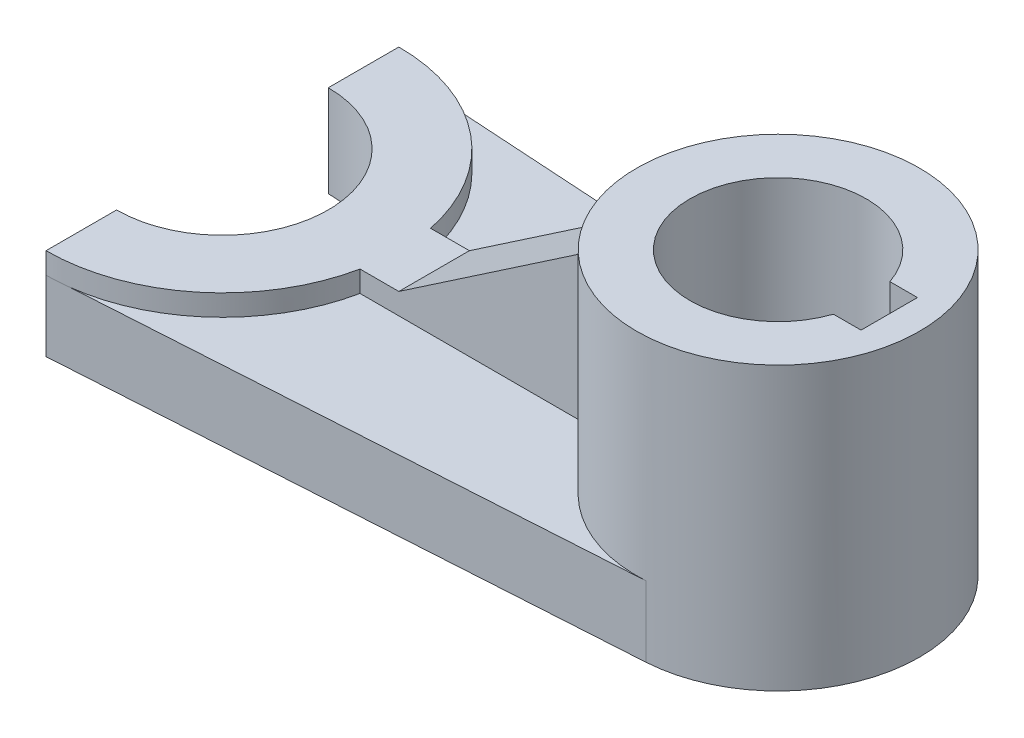
ISO-10303-21;
HEADER;
FILE_DESCRIPTION(('STEP AP214'),'2;1');
FILE_NAME('part.step','',(''),(''),'','','');
FILE_SCHEMA(('AUTOMOTIVE_DESIGN { 1 0 10303 214 1 1 1 1 }'));
ENDSEC;
DATA;
#1=APPLICATION_CONTEXT('core data for automotive mechanical design processes');
#2=APPLICATION_PROTOCOL_DEFINITION('international standard','automotive_design',2000,#1);
#3=PRODUCT_CONTEXT('',#1,'mechanical');
#4=PRODUCT('Part','Part','',(#3));
#5=PRODUCT_RELATED_PRODUCT_CATEGORY('part','',(#4));
#6=PRODUCT_DEFINITION_FORMATION('','',#4);
#7=PRODUCT_DEFINITION_CONTEXT('part definition',#1,'design');
#8=PRODUCT_DEFINITION('design','',#6,#7);
#9=PRODUCT_DEFINITION_SHAPE('','',#8);
#10=(LENGTH_UNIT() NAMED_UNIT(*) SI_UNIT(.MILLI.,.METRE.));
#11=(NAMED_UNIT(*) PLANE_ANGLE_UNIT() SI_UNIT($,.RADIAN.));
#12=(NAMED_UNIT(*) SI_UNIT($,.STERADIAN.) SOLID_ANGLE_UNIT());
#13=UNCERTAINTY_MEASURE_WITH_UNIT(LENGTH_MEASURE(1.E-05),#10,'distance_accuracy_value','');
#14=(GEOMETRIC_REPRESENTATION_CONTEXT(3) GLOBAL_UNCERTAINTY_ASSIGNED_CONTEXT((#13)) GLOBAL_UNIT_ASSIGNED_CONTEXT((#10,
#11,#12)) REPRESENTATION_CONTEXT('',''));
#15=CARTESIAN_POINT('',(0.,0.,0.));
#16=DIRECTION('',(0.,0.,1.));
#17=DIRECTION('',(1.,0.,0.));
#18=AXIS2_PLACEMENT_3D('',#15,#16,#17);
#19=CARTESIAN_POINT('',(-1.24999999999999,10.,0.));
#20=DIRECTION('',(0.,-1.,0.));
#21=DIRECTION('',(0.,0.,-1.));
#22=AXIS2_PLACEMENT_3D('',#19,#20,#21);
#23=PLANE('',#22);
#24=DIRECTION('',(-1.,0.,0.));
#25=VECTOR('',#24,1.);
#26=CARTESIAN_POINT('',(-1.24999999999999,10.,-5.));
#27=LINE('',#26,#25);
#28=CARTESIAN_POINT('',(-20.655218370325,10.,-5.));
#29=VERTEX_POINT('',#28);
#30=CARTESIAN_POINT('',(-55.5051025721682,10.,-5.));
#31=VERTEX_POINT('',#30);
#32=EDGE_CURVE('E203',#29,#31,#27,.T.);
#33=ORIENTED_EDGE('',*,*,#32,.F.);
#34=CARTESIAN_POINT('',(-1.24999999999999,10.,0.));
#35=DIRECTION('',(0.,-1.,0.));
#36=DIRECTION('',(0.,0.,-1.));
#37=AXIS2_PLACEMENT_3D('',#34,#35,#36);
#38=CIRCLE('',#37,20.0390244273518);
#39=CARTESIAN_POINT('',(0.,10.,-20.));
#40=VERTEX_POINT('',#39);
#41=EDGE_CURVE('E280',#40,#29,#38,.F.);
#42=ORIENTED_EDGE('',*,*,#41,.F.);
#43=DIRECTION('',(0.998052578482889,0.,0.0623782861551805));
#44=VECTOR('',#43,1.);
#45=CARTESIAN_POINT('',(-80.,10.,-25.));
#46=LINE('',#45,#44);
#47=CARTESIAN_POINT('',(-76.8871595330739,10.,-24.8054474708171));
#48=VERTEX_POINT('',#47);
#49=EDGE_CURVE('E254',#48,#40,#46,.T.);
#50=ORIENTED_EDGE('',*,*,#49,.F.);
#51=CARTESIAN_POINT('',(-80.,10.,0.));
#52=DIRECTION('',(0.,-1.,0.));
#53=DIRECTION('',(0.,0.,-1.));
#54=AXIS2_PLACEMENT_3D('',#51,#52,#53);
#55=CIRCLE('',#54,25.);
#56=EDGE_CURVE('E236',#48,#31,#55,.T.);
#57=ORIENTED_EDGE('',*,*,#56,.T.);
#58=EDGE_LOOP('',(#33,#42,#50,#57));
#59=FACE_BOUND('',#58,.T.);
#60=ADVANCED_FACE('F35',(#59),#23,.F.);
#61=CARTESIAN_POINT('',(-80.,13.,0.));
#62=DIRECTION('',(0.,-1.,0.));
#63=DIRECTION('',(0.,0.,-1.));
#64=AXIS2_PLACEMENT_3D('',#61,#62,#63);
#65=CYLINDRICAL_SURFACE('',#64,25.);
#66=CARTESIAN_POINT('',(-80.,13.,0.));
#67=DIRECTION('',(0.,-1.,0.));
#68=DIRECTION('',(0.,0.,-1.));
#69=AXIS2_PLACEMENT_3D('',#66,#67,#68);
#70=CIRCLE('',#69,25.);
#71=CARTESIAN_POINT('',(-80.,13.,-25.));
#72=VERTEX_POINT('',#71);
#73=CARTESIAN_POINT('',(-55.5051025721682,13.,-5.));
#74=VERTEX_POINT('',#73);
#75=EDGE_CURVE('E227',#72,#74,#70,.T.);
#76=ORIENTED_EDGE('',*,*,#75,.T.);
#77=DIRECTION('',(0.,-1.,0.));
#78=VECTOR('',#77,1.);
#79=CARTESIAN_POINT('',(-55.5051025721682,13.,-5.));
#80=LINE('',#79,#78);
#81=EDGE_CURVE('E201',#74,#31,#80,.T.);
#82=ORIENTED_EDGE('',*,*,#81,.T.);
#83=ORIENTED_EDGE('',*,*,#56,.F.);
#84=CARTESIAN_POINT('',(-80.,10.,-25.));
#85=VERTEX_POINT('',#84);
#86=EDGE_CURVE('E223',#85,#48,#55,.T.);
#87=ORIENTED_EDGE('',*,*,#86,.F.);
#88=DIRECTION('',(0.,-1.,0.));
#89=VECTOR('',#88,1.);
#90=CARTESIAN_POINT('',(-80.,13.,-25.));
#91=LINE('',#90,#89);
#92=EDGE_CURVE('E232',#72,#85,#91,.T.);
#93=ORIENTED_EDGE('',*,*,#92,.F.);
#94=EDGE_LOOP('',(#76,#82,#83,#87,#93));
#95=FACE_BOUND('',#94,.T.);
#96=ADVANCED_FACE('F303',(#95),#65,.T.);
#97=CARTESIAN_POINT('',(-80.,10.,-25.));
#98=DIRECTION('',(1.,0.,0.));
#99=DIRECTION('',(0.,0.,-1.));
#100=AXIS2_PLACEMENT_3D('',#97,#98,#99);
#101=PLANE('',#100);
#102=DIRECTION('',(0.,-1.,0.));
#103=VECTOR('',#102,1.);
#104=CARTESIAN_POINT('',(-80.,10.,25.));
#105=LINE('',#104,#103);
#106=CARTESIAN_POINT('',(-80.,10.,25.));
#107=VERTEX_POINT('',#106);
#108=CARTESIAN_POINT('',(-80.,0.,25.));
#109=VERTEX_POINT('',#108);
#110=EDGE_CURVE('E277',#107,#109,#105,.T.);
#111=ORIENTED_EDGE('',*,*,#110,.F.);
#112=DIRECTION('',(0.,-1.,0.));
#113=VECTOR('',#112,1.);
#114=CARTESIAN_POINT('',(-80.,13.,25.));
#115=LINE('',#114,#113);
#116=CARTESIAN_POINT('',(-80.,13.,25.));
#117=VERTEX_POINT('',#116);
#118=EDGE_CURVE('E239',#117,#107,#115,.T.);
#119=ORIENTED_EDGE('',*,*,#118,.F.);
#120=DIRECTION('',(0.,0.,-1.));
#121=VECTOR('',#120,1.);
#122=CARTESIAN_POINT('',(-80.,13.,25.));
#123=LINE('',#122,#121);
#124=CARTESIAN_POINT('',(-80.,13.,15.));
#125=VERTEX_POINT('',#124);
#126=EDGE_CURVE('E222',#117,#125,#123,.T.);
#127=ORIENTED_EDGE('',*,*,#126,.T.);
#128=DIRECTION('',(0.,-1.,0.));
#129=VECTOR('',#128,1.);
#130=CARTESIAN_POINT('',(-80.,161.46532474027,15.));
#131=LINE('',#130,#129);
#132=CARTESIAN_POINT('',(-80.,0.,15.));
#133=VERTEX_POINT('',#132);
#134=EDGE_CURVE('E244',#125,#133,#131,.T.);
#135=ORIENTED_EDGE('',*,*,#134,.T.);
#136=DIRECTION('',(0.,0.,1.));
#137=VECTOR('',#136,1.);
#138=CARTESIAN_POINT('',(-80.,0.,-25.));
#139=LINE('',#138,#137);
#140=EDGE_CURVE('E250',#133,#109,#139,.T.);
#141=ORIENTED_EDGE('',*,*,#140,.T.);
#142=EDGE_LOOP('',(#111,#119,#127,#135,#141));
#143=FACE_BOUND('',#142,.T.);
#144=ADVANCED_FACE('F310',(#143),#101,.F.);
#145=CARTESIAN_POINT('',(-1.24999999999999,0.,0.));
#146=DIRECTION('',(0.,-1.,0.));
#147=DIRECTION('',(0.,0.,-1.));
#148=AXIS2_PLACEMENT_3D('',#145,#146,#147);
#149=PLANE('',#148);
#150=DIRECTION('',(-1.,0.,0.));
#151=VECTOR('',#150,1.);
#152=CARTESIAN_POINT('',(0.,0.,-4.));
#153=LINE('',#152,#151);
#154=CARTESIAN_POINT('',(14.5,0.,-4.));
#155=VERTEX_POINT('',#154);
#156=CARTESIAN_POINT('',(10.592719282327,0.,-4.));
#157=VERTEX_POINT('',#156);
#158=EDGE_CURVE('E161',#155,#157,#153,.T.);
#159=ORIENTED_EDGE('',*,*,#158,.T.);
#160=CARTESIAN_POINT('',(-1.24999999999999,0.,0.));
#161=DIRECTION('',(0.,1.,0.));
#162=DIRECTION('',(0.,0.,1.));
#163=AXIS2_PLACEMENT_3D('',#160,#161,#162);
#164=CIRCLE('',#163,12.5);
#165=CARTESIAN_POINT('',(10.592719282327,0.,4.));
#166=VERTEX_POINT('',#165);
#167=EDGE_CURVE('E174',#157,#166,#164,.T.);
#168=ORIENTED_EDGE('',*,*,#167,.T.);
#169=DIRECTION('',(1.,0.,0.));
#170=VECTOR('',#169,1.);
#171=CARTESIAN_POINT('',(0.,0.,4.));
#172=LINE('',#171,#170);
#173=CARTESIAN_POINT('',(14.5,0.,4.));
#174=VERTEX_POINT('',#173);
#175=EDGE_CURVE('E50',#166,#174,#172,.T.);
#176=ORIENTED_EDGE('',*,*,#175,.T.);
#177=DIRECTION('',(0.,0.,-1.));
#178=VECTOR('',#177,1.);
#179=CARTESIAN_POINT('',(14.5,0.,4.));
#180=LINE('',#179,#178);
#181=EDGE_CURVE('E164',#174,#155,#180,.T.);
#182=ORIENTED_EDGE('',*,*,#181,.T.);
#183=EDGE_LOOP('',(#159,#168,#176,#182));
#184=FACE_BOUND('',#183,.T.);
#185=CARTESIAN_POINT('',(-80.,0.,0.));
#186=DIRECTION('',(0.,-1.,0.));
#187=DIRECTION('',(0.,0.,-1.));
#188=AXIS2_PLACEMENT_3D('',#185,#186,#187);
#189=CIRCLE('',#188,15.);
#190=CARTESIAN_POINT('',(-80.,0.,-15.));
#191=VERTEX_POINT('',#190);
#192=EDGE_CURVE('E242',#133,#191,#189,.F.);
#193=ORIENTED_EDGE('',*,*,#192,.T.);
#194=CARTESIAN_POINT('',(-80.,0.,-25.));
#195=VERTEX_POINT('',#194);
#196=EDGE_CURVE('E260',#195,#191,#139,.T.);
#197=ORIENTED_EDGE('',*,*,#196,.F.);
#198=DIRECTION('',(0.998052578482889,0.,0.0623782861551805));
#199=VECTOR('',#198,1.);
#200=CARTESIAN_POINT('',(-80.,0.,-25.));
#201=LINE('',#200,#199);
#202=CARTESIAN_POINT('',(0.,0.,-20.));
#203=VERTEX_POINT('',#202);
#204=EDGE_CURVE('E268',#195,#203,#201,.T.);
#205=ORIENTED_EDGE('',*,*,#204,.T.);
#206=CARTESIAN_POINT('',(-1.24999999999999,0.,0.));
#207=DIRECTION('',(0.,-1.,0.));
#208=DIRECTION('',(0.,0.,-1.));
#209=AXIS2_PLACEMENT_3D('',#206,#207,#208);
#210=CIRCLE('',#209,20.0390244273517);
#211=CARTESIAN_POINT('',(0.,0.,20.));
#212=VERTEX_POINT('',#211);
#213=EDGE_CURVE('E266',#203,#212,#210,.T.);
#214=ORIENTED_EDGE('',*,*,#213,.T.);
#215=DIRECTION('',(0.998052578482889,0.,-0.0623782861551805));
#216=VECTOR('',#215,1.);
#217=CARTESIAN_POINT('',(-80.,0.,25.));
#218=LINE('',#217,#216);
#219=EDGE_CURVE('E263',#109,#212,#218,.T.);
#220=ORIENTED_EDGE('',*,*,#219,.F.);
#221=ORIENTED_EDGE('',*,*,#140,.F.);
#222=EDGE_LOOP('',(#193,#197,#205,#214,#220,#221));
#223=FACE_BOUND('',#222,.T.);
#224=ADVANCED_FACE('F171',(#184,#223),#149,.T.);
#225=ORIENTED_EDGE('',*,*,#196,.T.);
#226=DIRECTION('',(0.,-1.,0.));
#227=VECTOR('',#226,1.);
#228=CARTESIAN_POINT('',(-80.,161.46532474027,-15.));
#229=LINE('',#228,#227);
#230=CARTESIAN_POINT('',(-80.,13.,-15.));
#231=VERTEX_POINT('',#230);
#232=EDGE_CURVE('E247',#231,#191,#229,.T.);
#233=ORIENTED_EDGE('',*,*,#232,.F.);
#234=DIRECTION('',(0.,0.,-1.));
#235=VECTOR('',#234,1.);
#236=CARTESIAN_POINT('',(-80.,13.,-15.));
#237=LINE('',#236,#235);
#238=EDGE_CURVE('E229',#231,#72,#237,.T.);
#239=ORIENTED_EDGE('',*,*,#238,.T.);
#240=ORIENTED_EDGE('',*,*,#92,.T.);
#241=DIRECTION('',(0.,-1.,0.));
#242=VECTOR('',#241,1.);
#243=CARTESIAN_POINT('',(-80.,10.,-25.));
#244=LINE('',#243,#242);
#245=EDGE_CURVE('E259',#85,#195,#244,.T.);
#246=ORIENTED_EDGE('',*,*,#245,.T.);
#247=EDGE_LOOP('',(#225,#233,#239,#240,#246));
#248=FACE_BOUND('',#247,.T.);
#249=ADVANCED_FACE('F37',(#248),#101,.F.);
#250=CARTESIAN_POINT('',(-80.,10.,25.));
#251=DIRECTION('',(-0.0623782861551805,0.,-0.998052578482888));
#252=DIRECTION('',(-0.998052578482889,0.,0.0623782861551805));
#253=AXIS2_PLACEMENT_3D('',#250,#251,#252);
#254=PLANE('',#253);
#255=ORIENTED_EDGE('',*,*,#219,.T.);
#256=DIRECTION('',(0.,-1.,0.));
#257=VECTOR('',#256,1.);
#258=CARTESIAN_POINT('',(0.,10.,20.));
#259=LINE('',#258,#257);
#260=CARTESIAN_POINT('',(0.,10.,20.));
#261=VERTEX_POINT('',#260);
#262=EDGE_CURVE('E274',#261,#212,#259,.T.);
#263=ORIENTED_EDGE('',*,*,#262,.F.);
#264=DIRECTION('',(0.998052578482889,0.,-0.0623782861551805));
#265=VECTOR('',#264,1.);
#266=CARTESIAN_POINT('',(-80.,10.,25.));
#267=LINE('',#266,#265);
#268=CARTESIAN_POINT('',(-76.8871595330739,10.,24.8054474708171));
#269=VERTEX_POINT('',#268);
#270=EDGE_CURVE('E255',#269,#261,#267,.T.);
#271=ORIENTED_EDGE('',*,*,#270,.F.);
#272=EDGE_CURVE('E251',#107,#269,#267,.T.);
#273=ORIENTED_EDGE('',*,*,#272,.F.);
#274=ORIENTED_EDGE('',*,*,#110,.T.);
#275=EDGE_LOOP('',(#255,#263,#271,#273,#274));
#276=FACE_BOUND('',#275,.T.);
#277=ADVANCED_FACE('F350',(#276),#254,.F.);
#278=CARTESIAN_POINT('',(-1.24999999999999,10.,0.));
#279=DIRECTION('',(0.,-1.,0.));
#280=DIRECTION('',(0.,0.,-1.));
#281=AXIS2_PLACEMENT_3D('',#278,#279,#280);
#282=CYLINDRICAL_SURFACE('',#281,20.0390244273517);
#283=ORIENTED_EDGE('',*,*,#262,.T.);
#284=ORIENTED_EDGE('',*,*,#213,.F.);
#285=DIRECTION('',(0.,-1.,0.));
#286=VECTOR('',#285,1.);
#287=CARTESIAN_POINT('',(0.,10.,-20.));
#288=LINE('',#287,#286);
#289=EDGE_CURVE('E272',#40,#203,#288,.T.);
#290=ORIENTED_EDGE('',*,*,#289,.F.);
#291=ORIENTED_EDGE('',*,*,#41,.T.);
#292=DIRECTION('',(0.,-1.,0.));
#293=VECTOR('',#292,1.);
#294=CARTESIAN_POINT('',(-20.655218370325,10.,-5.));
#295=LINE('',#294,#293);
#296=CARTESIAN_POINT('',(-20.655218370325,32.930470155246,-5.));
#297=VERTEX_POINT('',#296);
#298=EDGE_CURVE('E206',#29,#297,#295,.F.);
#299=ORIENTED_EDGE('',*,*,#298,.T.);
#300=CARTESIAN_POINT('',(-1.24999999999999,46.1101601753171,0.));
#301=DIRECTION('',(0.561847649896516,-0.827240725729677,0.));
#302=DIRECTION('',(-0.827240725729677,-0.561847649896516,0.));
#303=AXIS2_PLACEMENT_3D('',#300,#301,#302);
#304=ELLIPSE('',#303,24.2239336194142,20.0390244273517);
#305=CARTESIAN_POINT('',(-20.655218370325,32.930470155246,5.));
#306=VERTEX_POINT('',#305);
#307=EDGE_CURVE('E58',#306,#297,#304,.T.);
#308=ORIENTED_EDGE('',*,*,#307,.F.);
#309=DIRECTION('',(0.,-1.,0.));
#310=VECTOR('',#309,1.);
#311=CARTESIAN_POINT('',(-20.655218370325,10.,5.));
#312=LINE('',#311,#310);
#313=CARTESIAN_POINT('',(-20.655218370325,10.,5.));
#314=VERTEX_POINT('',#313);
#315=EDGE_CURVE('E213',#314,#306,#312,.F.);
#316=ORIENTED_EDGE('',*,*,#315,.F.);
#317=EDGE_CURVE('E282',#314,#261,#38,.F.);
#318=ORIENTED_EDGE('',*,*,#317,.T.);
#319=EDGE_LOOP('',(#283,#284,#290,#291,#299,#308,#316,#318));
#320=FACE_BOUND('',#319,.T.);
#321=CARTESIAN_POINT('',(-1.24999999999999,40.,0.));
#322=DIRECTION('',(0.,1.,0.));
#323=DIRECTION('',(0.,0.,1.));
#324=AXIS2_PLACEMENT_3D('',#321,#322,#323);
#325=CIRCLE('',#324,20.0390244273518);
#326=CARTESIAN_POINT('',(-1.24999999999999,40.,20.0390244273517));
#327=VERTEX_POINT('',#326);
#328=EDGE_CURVE('E216',#327,#327,#325,.T.);
#329=ORIENTED_EDGE('',*,*,#328,.F.);
#330=EDGE_LOOP('',(#329));
#331=FACE_BOUND('',#330,.T.);
#332=ADVANCED_FACE('F326',(#320,#331),#282,.T.);
#333=CARTESIAN_POINT('',(-80.,10.,-25.));
#334=DIRECTION('',(0.0623782861551805,0.,-0.998052578482888));
#335=DIRECTION('',(-0.998052578482889,0.,-0.0623782861551805));
#336=AXIS2_PLACEMENT_3D('',#333,#334,#335);
#337=PLANE('',#336);
#338=ORIENTED_EDGE('',*,*,#204,.F.);
#339=ORIENTED_EDGE('',*,*,#245,.F.);
#340=EDGE_CURVE('E256',#85,#48,#46,.T.);
#341=ORIENTED_EDGE('',*,*,#340,.T.);
#342=ORIENTED_EDGE('',*,*,#49,.T.);
#343=ORIENTED_EDGE('',*,*,#289,.T.);
#344=EDGE_LOOP('',(#338,#339,#341,#342,#343));
#345=FACE_BOUND('',#344,.T.);
#346=ADVANCED_FACE('F318',(#345),#337,.T.);
#347=ORIENTED_EDGE('',*,*,#317,.F.);
#348=DIRECTION('',(-1.,0.,0.));
#349=VECTOR('',#348,1.);
#350=CARTESIAN_POINT('',(-1.24999999999999,10.,5.));
#351=LINE('',#350,#349);
#352=CARTESIAN_POINT('',(-55.5051025721682,10.,5.));
#353=VERTEX_POINT('',#352);
#354=EDGE_CURVE('E211',#314,#353,#351,.T.);
#355=ORIENTED_EDGE('',*,*,#354,.T.);
#356=EDGE_CURVE('E235',#353,#269,#55,.T.);
#357=ORIENTED_EDGE('',*,*,#356,.T.);
#358=ORIENTED_EDGE('',*,*,#270,.T.);
#359=EDGE_LOOP('',(#347,#355,#357,#358));
#360=FACE_BOUND('',#359,.T.);
#361=ADVANCED_FACE('F306',(#360),#23,.F.);
#362=CARTESIAN_POINT('',(-80.,161.46532474027,0.));
#363=DIRECTION('',(0.,-1.,0.));
#364=DIRECTION('',(0.,0.,-1.));
#365=AXIS2_PLACEMENT_3D('',#362,#363,#364);
#366=CYLINDRICAL_SURFACE('',#365,15.);
#367=ORIENTED_EDGE('',*,*,#134,.F.);
#368=CARTESIAN_POINT('',(-80.,13.,0.));
#369=DIRECTION('',(0.,1.,0.));
#370=DIRECTION('',(1.,0.,0.));
#371=AXIS2_PLACEMENT_3D('',#368,#369,#370);
#372=CIRCLE('',#371,15.);
#373=EDGE_CURVE('E220',#231,#125,#372,.F.);
#374=ORIENTED_EDGE('',*,*,#373,.F.);
#375=ORIENTED_EDGE('',*,*,#232,.T.);
#376=ORIENTED_EDGE('',*,*,#192,.F.);
#377=EDGE_LOOP('',(#367,#374,#375,#376));
#378=FACE_BOUND('',#377,.T.);
#379=ADVANCED_FACE('F317',(#378),#366,.F.);
#380=CARTESIAN_POINT('',(-80.,10.,0.));
#381=DIRECTION('',(0.,1.,0.));
#382=DIRECTION('',(1.,0.,0.));
#383=AXIS2_PLACEMENT_3D('',#380,#381,#382);
#384=PLANE('',#383);
#385=EDGE_CURVE('E219',#269,#107,#55,.T.);
#386=ORIENTED_EDGE('',*,*,#385,.T.);
#387=ORIENTED_EDGE('',*,*,#272,.T.);
#388=EDGE_LOOP('',(#386,#387));
#389=FACE_BOUND('',#388,.T.);
#390=ADVANCED_FACE('F324',(#389),#384,.F.);
#391=DIRECTION('',(0.,-1.,0.));
#392=VECTOR('',#391,1.);
#393=CARTESIAN_POINT('',(-55.5051025721682,13.,5.));
#394=LINE('',#393,#392);
#395=CARTESIAN_POINT('',(-55.5051025721682,13.,5.));
#396=VERTEX_POINT('',#395);
#397=EDGE_CURVE('E208',#396,#353,#394,.T.);
#398=ORIENTED_EDGE('',*,*,#397,.F.);
#399=EDGE_CURVE('E226',#396,#117,#70,.T.);
#400=ORIENTED_EDGE('',*,*,#399,.T.);
#401=ORIENTED_EDGE('',*,*,#118,.T.);
#402=ORIENTED_EDGE('',*,*,#385,.F.);
#403=ORIENTED_EDGE('',*,*,#356,.F.);
#404=EDGE_LOOP('',(#398,#400,#401,#402,#403));
#405=FACE_BOUND('',#404,.T.);
#406=ADVANCED_FACE('F313',(#405),#65,.T.);
#407=CARTESIAN_POINT('',(-80.,13.,0.));
#408=DIRECTION('',(0.,1.,0.));
#409=DIRECTION('',(1.,0.,0.));
#410=AXIS2_PLACEMENT_3D('',#407,#408,#409);
#411=PLANE('',#410);
#412=ORIENTED_EDGE('',*,*,#399,.F.);
#413=DIRECTION('',(1.,0.,0.));
#414=VECTOR('',#413,1.);
#415=CARTESIAN_POINT('',(-30.6054877863241,13.,5.));
#416=LINE('',#415,#414);
#417=CARTESIAN_POINT('',(-50.,13.,5.));
#418=VERTEX_POINT('',#417);
#419=EDGE_CURVE('E189',#396,#418,#416,.T.);
#420=ORIENTED_EDGE('',*,*,#419,.T.);
#421=DIRECTION('',(0.,0.,1.));
#422=VECTOR('',#421,1.);
#423=CARTESIAN_POINT('',(-50.,13.,0.));
#424=LINE('',#423,#422);
#425=CARTESIAN_POINT('',(-50.,13.,-5.));
#426=VERTEX_POINT('',#425);
#427=EDGE_CURVE('E191',#426,#418,#424,.T.);
#428=ORIENTED_EDGE('',*,*,#427,.F.);
#429=DIRECTION('',(1.,0.,0.));
#430=VECTOR('',#429,1.);
#431=CARTESIAN_POINT('',(-30.6054877863241,13.,-5.));
#432=LINE('',#431,#430);
#433=EDGE_CURVE('E195',#74,#426,#432,.T.);
#434=ORIENTED_EDGE('',*,*,#433,.F.);
#435=ORIENTED_EDGE('',*,*,#75,.F.);
#436=ORIENTED_EDGE('',*,*,#238,.F.);
#437=ORIENTED_EDGE('',*,*,#373,.T.);
#438=ORIENTED_EDGE('',*,*,#126,.F.);
#439=EDGE_LOOP('',(#412,#420,#428,#434,#435,#436,#437,#438));
#440=FACE_BOUND('',#439,.T.);
#441=ADVANCED_FACE('F371',(#440),#411,.T.);
#442=ORIENTED_EDGE('',*,*,#340,.F.);
#443=ORIENTED_EDGE('',*,*,#86,.T.);
#444=EDGE_LOOP('',(#442,#443));
#445=FACE_BOUND('',#444,.T.);
#446=ADVANCED_FACE('F378',(#445),#384,.F.);
#447=CARTESIAN_POINT('',(-1.24999999999999,40.,0.));
#448=DIRECTION('',(0.,1.,0.));
#449=DIRECTION('',(0.,0.,1.));
#450=AXIS2_PLACEMENT_3D('',#447,#448,#449);
#451=PLANE('',#450);
#452=DIRECTION('',(-1.,0.,0.));
#453=VECTOR('',#452,1.);
#454=CARTESIAN_POINT('',(0.,40.,-4.));
#455=LINE('',#454,#453);
#456=CARTESIAN_POINT('',(14.5,40.,-4.));
#457=VERTEX_POINT('',#456);
#458=CARTESIAN_POINT('',(10.592719282327,40.,-4.));
#459=VERTEX_POINT('',#458);
#460=EDGE_CURVE('E175',#457,#459,#455,.T.);
#461=ORIENTED_EDGE('',*,*,#460,.F.);
#462=DIRECTION('',(0.,0.,-1.));
#463=VECTOR('',#462,1.);
#464=CARTESIAN_POINT('',(14.5,40.,4.));
#465=LINE('',#464,#463);
#466=CARTESIAN_POINT('',(14.5,40.,4.));
#467=VERTEX_POINT('',#466);
#468=EDGE_CURVE('E177',#467,#457,#465,.T.);
#469=ORIENTED_EDGE('',*,*,#468,.F.);
#470=DIRECTION('',(1.,0.,0.));
#471=VECTOR('',#470,1.);
#472=CARTESIAN_POINT('',(0.,40.,4.));
#473=LINE('',#472,#471);
#474=CARTESIAN_POINT('',(10.592719282327,40.,4.));
#475=VERTEX_POINT('',#474);
#476=EDGE_CURVE('E156',#475,#467,#473,.T.);
#477=ORIENTED_EDGE('',*,*,#476,.F.);
#478=CARTESIAN_POINT('',(-1.24999999999999,40.,0.));
#479=DIRECTION('',(0.,1.,0.));
#480=DIRECTION('',(0.,0.,1.));
#481=AXIS2_PLACEMENT_3D('',#478,#479,#480);
#482=CIRCLE('',#481,12.5);
#483=EDGE_CURVE('E183',#459,#475,#482,.T.);
#484=ORIENTED_EDGE('',*,*,#483,.F.);
#485=EDGE_LOOP('',(#461,#469,#477,#484));
#486=FACE_BOUND('',#485,.T.);
#487=ORIENTED_EDGE('',*,*,#328,.T.);
#488=EDGE_LOOP('',(#487));
#489=FACE_BOUND('',#488,.T.);
#490=ADVANCED_FACE('F288',(#486,#489),#451,.T.);
#491=CARTESIAN_POINT('',(-50.,13.,0.));
#492=DIRECTION('',(0.561847649896516,-0.827240725729677,0.));
#493=DIRECTION('',(0.827240725729677,0.561847649896516,0.));
#494=AXIS2_PLACEMENT_3D('',#491,#492,#493);
#495=PLANE('',#494);
#496=DIRECTION('',(0.827240725729677,0.561847649896516,0.));
#497=VECTOR('',#496,1.);
#498=CARTESIAN_POINT('',(-50.,13.,5.));
#499=LINE('',#498,#497);
#500=EDGE_CURVE('E192',#418,#306,#499,.T.);
#501=ORIENTED_EDGE('',*,*,#500,.T.);
#502=ORIENTED_EDGE('',*,*,#307,.T.);
#503=DIRECTION('',(0.827240725729677,0.561847649896516,0.));
#504=VECTOR('',#503,1.);
#505=CARTESIAN_POINT('',(-50.,13.,-5.));
#506=LINE('',#505,#504);
#507=EDGE_CURVE('E188',#426,#297,#506,.T.);
#508=ORIENTED_EDGE('',*,*,#507,.F.);
#509=ORIENTED_EDGE('',*,*,#427,.T.);
#510=EDGE_LOOP('',(#501,#502,#508,#509));
#511=FACE_BOUND('',#510,.T.);
#512=ADVANCED_FACE('F369',(#511),#495,.F.);
#513=CARTESIAN_POINT('',(-30.6054877863241,20.,5.));
#514=DIRECTION('',(0.,0.,1.));
#515=DIRECTION('',(1.,0.,0.));
#516=AXIS2_PLACEMENT_3D('',#513,#514,#515);
#517=PLANE('',#516);
#518=ORIENTED_EDGE('',*,*,#354,.F.);
#519=ORIENTED_EDGE('',*,*,#315,.T.);
#520=ORIENTED_EDGE('',*,*,#500,.F.);
#521=ORIENTED_EDGE('',*,*,#419,.F.);
#522=ORIENTED_EDGE('',*,*,#397,.T.);
#523=EDGE_LOOP('',(#518,#519,#520,#521,#522));
#524=FACE_BOUND('',#523,.T.);
#525=ADVANCED_FACE('F336',(#524),#517,.T.);
#526=CARTESIAN_POINT('',(-30.6054877863241,20.,-5.));
#527=DIRECTION('',(0.,0.,1.));
#528=DIRECTION('',(1.,0.,0.));
#529=AXIS2_PLACEMENT_3D('',#526,#527,#528);
#530=PLANE('',#529);
#531=ORIENTED_EDGE('',*,*,#298,.F.);
#532=ORIENTED_EDGE('',*,*,#32,.T.);
#533=ORIENTED_EDGE('',*,*,#81,.F.);
#534=ORIENTED_EDGE('',*,*,#433,.T.);
#535=ORIENTED_EDGE('',*,*,#507,.T.);
#536=EDGE_LOOP('',(#531,#532,#533,#534,#535));
#537=FACE_BOUND('',#536,.T.);
#538=ADVANCED_FACE('F299',(#537),#530,.F.);
#539=CARTESIAN_POINT('',(-1.24999999999999,40.,0.));
#540=DIRECTION('',(0.,1.,0.));
#541=DIRECTION('',(0.,0.,1.));
#542=AXIS2_PLACEMENT_3D('',#539,#540,#541);
#543=CYLINDRICAL_SURFACE('',#542,12.5);
#544=ORIENTED_EDGE('',*,*,#167,.F.);
#545=DIRECTION('',(0.,1.,0.));
#546=VECTOR('',#545,1.);
#547=CARTESIAN_POINT('',(10.592719282327,40.,-4.));
#548=LINE('',#547,#546);
#549=EDGE_CURVE('E11',#157,#459,#548,.T.);
#550=ORIENTED_EDGE('',*,*,#549,.T.);
#551=ORIENTED_EDGE('',*,*,#483,.T.);
#552=DIRECTION('',(0.,1.,0.));
#553=VECTOR('',#552,1.);
#554=CARTESIAN_POINT('',(10.592719282327,40.,4.));
#555=LINE('',#554,#553);
#556=EDGE_CURVE('E43',#475,#166,#555,.F.);
#557=ORIENTED_EDGE('',*,*,#556,.T.);
#558=EDGE_LOOP('',(#544,#550,#551,#557));
#559=FACE_BOUND('',#558,.T.);
#560=ADVANCED_FACE('F284',(#559),#543,.F.);
#561=CARTESIAN_POINT('',(0.,0.,-4.));
#562=DIRECTION('',(0.,0.,-1.));
#563=DIRECTION('',(-1.,0.,0.));
#564=AXIS2_PLACEMENT_3D('',#561,#562,#563);
#565=PLANE('',#564);
#566=ORIENTED_EDGE('',*,*,#158,.F.);
#567=DIRECTION('',(0.,1.,0.));
#568=VECTOR('',#567,1.);
#569=CARTESIAN_POINT('',(14.5,0.,-4.));
#570=LINE('',#569,#568);
#571=EDGE_CURVE('E160',#155,#457,#570,.T.);
#572=ORIENTED_EDGE('',*,*,#571,.T.);
#573=ORIENTED_EDGE('',*,*,#460,.T.);
#574=ORIENTED_EDGE('',*,*,#549,.F.);
#575=EDGE_LOOP('',(#566,#572,#573,#574));
#576=FACE_BOUND('',#575,.T.);
#577=ADVANCED_FACE('F291',(#576),#565,.F.);
#578=CARTESIAN_POINT('',(0.,0.,4.));
#579=DIRECTION('',(0.,0.,1.));
#580=DIRECTION('',(1.,0.,0.));
#581=AXIS2_PLACEMENT_3D('',#578,#579,#580);
#582=PLANE('',#581);
#583=ORIENTED_EDGE('',*,*,#476,.T.);
#584=DIRECTION('',(0.,1.,0.));
#585=VECTOR('',#584,1.);
#586=CARTESIAN_POINT('',(14.5,0.,4.));
#587=LINE('',#586,#585);
#588=EDGE_CURVE('E152',#174,#467,#587,.T.);
#589=ORIENTED_EDGE('',*,*,#588,.F.);
#590=ORIENTED_EDGE('',*,*,#175,.F.);
#591=ORIENTED_EDGE('',*,*,#556,.F.);
#592=EDGE_LOOP('',(#583,#589,#590,#591));
#593=FACE_BOUND('',#592,.T.);
#594=ADVANCED_FACE('F154',(#593),#582,.F.);
#595=CARTESIAN_POINT('',(14.5,0.,4.));
#596=DIRECTION('',(1.,0.,0.));
#597=DIRECTION('',(0.,0.,-1.));
#598=AXIS2_PLACEMENT_3D('',#595,#596,#597);
#599=PLANE('',#598);
#600=ORIENTED_EDGE('',*,*,#468,.T.);
#601=ORIENTED_EDGE('',*,*,#571,.F.);
#602=ORIENTED_EDGE('',*,*,#181,.F.);
#603=ORIENTED_EDGE('',*,*,#588,.T.);
#604=EDGE_LOOP('',(#600,#601,#602,#603));
#605=FACE_BOUND('',#604,.T.);
#606=ADVANCED_FACE('F165',(#605),#599,.F.);
#607=CLOSED_SHELL('',(#60,#96,#144,#224,#249,#277,#332,#346,#361,#379,#390,#406,#441,#446,#490,
#512,#525,#538,#560,#577,#594,#606));
#608=MANIFOLD_SOLID_BREP('B2',#607);
#609=ADVANCED_BREP_SHAPE_REPRESENTATION('',(#18,#608),#14);
#610=SHAPE_DEFINITION_REPRESENTATION(#9,#609);
ENDSEC;
END-ISO-10303-21;
